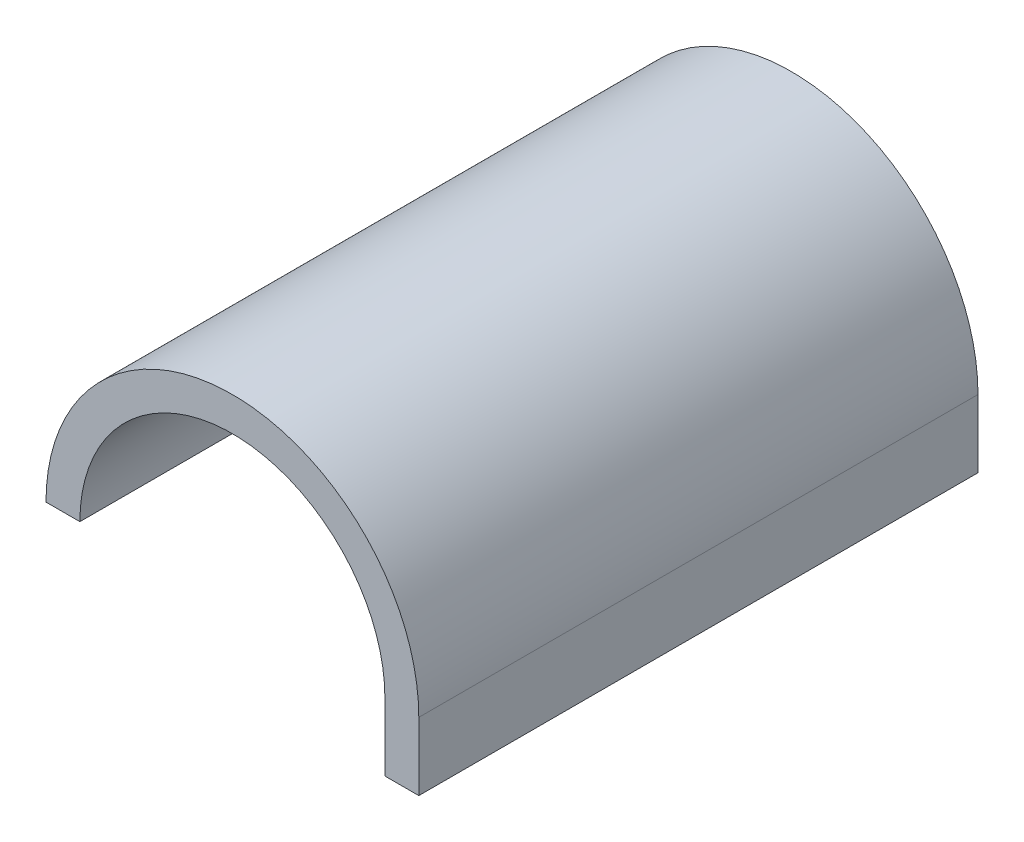
ISO-10303-21;
HEADER;
FILE_DESCRIPTION(('STEP AP214'),'2;1');
FILE_NAME('part.step','',(''),(''),'','','');
FILE_SCHEMA(('AUTOMOTIVE_DESIGN { 1 0 10303 214 1 1 1 1 }'));
ENDSEC;
DATA;
#1=APPLICATION_CONTEXT('core data for automotive mechanical design processes');
#2=APPLICATION_PROTOCOL_DEFINITION('international standard','automotive_design',2000,#1);
#3=PRODUCT_CONTEXT('',#1,'mechanical');
#4=PRODUCT('Part','Part','',(#3));
#5=PRODUCT_RELATED_PRODUCT_CATEGORY('part','',(#4));
#6=PRODUCT_DEFINITION_FORMATION('','',#4);
#7=PRODUCT_DEFINITION_CONTEXT('part definition',#1,'design');
#8=PRODUCT_DEFINITION('design','',#6,#7);
#9=PRODUCT_DEFINITION_SHAPE('','',#8);
#10=(LENGTH_UNIT() NAMED_UNIT(*) SI_UNIT(.MILLI.,.METRE.));
#11=(NAMED_UNIT(*) PLANE_ANGLE_UNIT() SI_UNIT($,.RADIAN.));
#12=(NAMED_UNIT(*) SI_UNIT($,.STERADIAN.) SOLID_ANGLE_UNIT());
#13=UNCERTAINTY_MEASURE_WITH_UNIT(LENGTH_MEASURE(1.E-05),#10,'distance_accuracy_value','');
#14=(GEOMETRIC_REPRESENTATION_CONTEXT(3) GLOBAL_UNCERTAINTY_ASSIGNED_CONTEXT((#13)) GLOBAL_UNIT_ASSIGNED_CONTEXT((#10,
#11,#12)) REPRESENTATION_CONTEXT('',''));
#15=CARTESIAN_POINT('',(0.,0.,0.));
#16=DIRECTION('',(0.,0.,1.));
#17=DIRECTION('',(1.,0.,0.));
#18=AXIS2_PLACEMENT_3D('',#15,#16,#17);
#19=CARTESIAN_POINT('',(0.,0.,82.5));
#20=DIRECTION('',(0.,0.,-1.));
#21=DIRECTION('',(-1.,0.,0.));
#22=AXIS2_PLACEMENT_3D('',#19,#20,#21);
#23=CYLINDRICAL_SURFACE('',#22,45.);
#24=CARTESIAN_POINT('',(0.,0.,-82.5));
#25=DIRECTION('',(0.,0.,-1.));
#26=DIRECTION('',(-1.,0.,0.));
#27=AXIS2_PLACEMENT_3D('',#24,#25,#26);
#28=CIRCLE('',#27,45.);
#29=CARTESIAN_POINT('',(-45.,0.,-82.5));
#30=VERTEX_POINT('',#29);
#31=CARTESIAN_POINT('',(45.,0.,-82.5));
#32=VERTEX_POINT('',#31);
#33=EDGE_CURVE('E115',#30,#32,#28,.T.);
#34=ORIENTED_EDGE('',*,*,#33,.T.);
#35=DIRECTION('',(0.,0.,-1.));
#36=VECTOR('',#35,1.);
#37=CARTESIAN_POINT('',(45.,0.,82.5));
#38=LINE('',#37,#36);
#39=CARTESIAN_POINT('',(45.,0.,82.5));
#40=VERTEX_POINT('',#39);
#41=EDGE_CURVE('E11',#40,#32,#38,.T.);
#42=ORIENTED_EDGE('',*,*,#41,.F.);
#43=CARTESIAN_POINT('',(0.,0.,82.5));
#44=DIRECTION('',(0.,0.,-1.));
#45=DIRECTION('',(-1.,0.,0.));
#46=AXIS2_PLACEMENT_3D('',#43,#44,#45);
#47=CIRCLE('',#46,45.);
#48=CARTESIAN_POINT('',(-45.,0.,82.5));
#49=VERTEX_POINT('',#48);
#50=EDGE_CURVE('E75',#49,#40,#47,.T.);
#51=ORIENTED_EDGE('',*,*,#50,.F.);
#52=DIRECTION('',(0.,0.,-1.));
#53=VECTOR('',#52,1.);
#54=CARTESIAN_POINT('',(-45.,0.,82.5));
#55=LINE('',#54,#53);
#56=EDGE_CURVE('E125',#49,#30,#55,.T.);
#57=ORIENTED_EDGE('',*,*,#56,.T.);
#58=EDGE_LOOP('',(#34,#42,#51,#57));
#59=FACE_BOUND('',#58,.T.);
#60=ADVANCED_FACE('F33',(#59),#23,.F.);
#61=CARTESIAN_POINT('',(0.,0.,82.5));
#62=DIRECTION('',(0.,0.,-1.));
#63=DIRECTION('',(-1.,0.,0.));
#64=AXIS2_PLACEMENT_3D('',#61,#62,#63);
#65=CYLINDRICAL_SURFACE('',#64,55.);
#66=CARTESIAN_POINT('',(0.,0.,-82.5));
#67=DIRECTION('',(0.,0.,1.));
#68=DIRECTION('',(-1.,0.,0.));
#69=AXIS2_PLACEMENT_3D('',#66,#67,#68);
#70=CIRCLE('',#69,55.);
#71=CARTESIAN_POINT('',(55.,0.,-82.5));
#72=VERTEX_POINT('',#71);
#73=CARTESIAN_POINT('',(-55.,0.,-82.5));
#74=VERTEX_POINT('',#73);
#75=EDGE_CURVE('E64',#72,#74,#70,.T.);
#76=ORIENTED_EDGE('',*,*,#75,.T.);
#77=DIRECTION('',(0.,0.,-1.));
#78=VECTOR('',#77,1.);
#79=CARTESIAN_POINT('',(-55.,0.,82.5));
#80=LINE('',#79,#78);
#81=CARTESIAN_POINT('',(-55.,0.,82.5));
#82=VERTEX_POINT('',#81);
#83=EDGE_CURVE('E130',#82,#74,#80,.T.);
#84=ORIENTED_EDGE('',*,*,#83,.F.);
#85=CARTESIAN_POINT('',(0.,0.,82.5));
#86=DIRECTION('',(0.,0.,1.));
#87=DIRECTION('',(-1.,0.,0.));
#88=AXIS2_PLACEMENT_3D('',#85,#86,#87);
#89=CIRCLE('',#88,55.);
#90=CARTESIAN_POINT('',(55.,0.,82.5));
#91=VERTEX_POINT('',#90);
#92=EDGE_CURVE('E123',#91,#82,#89,.T.);
#93=ORIENTED_EDGE('',*,*,#92,.F.);
#94=DIRECTION('',(0.,0.,-1.));
#95=VECTOR('',#94,1.);
#96=CARTESIAN_POINT('',(55.,0.,82.5));
#97=LINE('',#96,#95);
#98=EDGE_CURVE('E41',#91,#72,#97,.T.);
#99=ORIENTED_EDGE('',*,*,#98,.T.);
#100=EDGE_LOOP('',(#76,#84,#93,#99));
#101=FACE_BOUND('',#100,.T.);
#102=ADVANCED_FACE('F132',(#101),#65,.T.);
#103=CARTESIAN_POINT('',(-55.,0.,82.5));
#104=DIRECTION('',(0.,1.,0.));
#105=DIRECTION('',(-1.,0.,0.));
#106=AXIS2_PLACEMENT_3D('',#103,#104,#105);
#107=PLANE('',#106);
#108=DIRECTION('',(1.,0.,0.));
#109=VECTOR('',#108,1.);
#110=CARTESIAN_POINT('',(-55.,0.,-82.5));
#111=LINE('',#110,#109);
#112=EDGE_CURVE('E70',#74,#30,#111,.T.);
#113=ORIENTED_EDGE('',*,*,#112,.T.);
#114=ORIENTED_EDGE('',*,*,#56,.F.);
#115=DIRECTION('',(1.,0.,0.));
#116=VECTOR('',#115,1.);
#117=CARTESIAN_POINT('',(-55.,0.,82.5));
#118=LINE('',#117,#116);
#119=EDGE_CURVE('E49',#82,#49,#118,.T.);
#120=ORIENTED_EDGE('',*,*,#119,.F.);
#121=ORIENTED_EDGE('',*,*,#83,.T.);
#122=EDGE_LOOP('',(#113,#114,#120,#121));
#123=FACE_BOUND('',#122,.T.);
#124=ADVANCED_FACE('F142',(#123),#107,.F.);
#125=CARTESIAN_POINT('',(0.,0.,82.5));
#126=DIRECTION('',(0.,0.,-1.));
#127=DIRECTION('',(-1.,0.,0.));
#128=AXIS2_PLACEMENT_3D('',#125,#126,#127);
#129=PLANE('',#128);
#130=ORIENTED_EDGE('',*,*,#50,.T.);
#131=DIRECTION('',(0.,1.,0.));
#132=VECTOR('',#131,1.);
#133=CARTESIAN_POINT('',(45.,-20.,82.5));
#134=LINE('',#133,#132);
#135=CARTESIAN_POINT('',(45.,-20.,82.5));
#136=VERTEX_POINT('',#135);
#137=EDGE_CURVE('E138',#136,#40,#134,.T.);
#138=ORIENTED_EDGE('',*,*,#137,.F.);
#139=DIRECTION('',(-1.,0.,0.));
#140=VECTOR('',#139,1.);
#141=CARTESIAN_POINT('',(55.,-20.,82.5));
#142=LINE('',#141,#140);
#143=CARTESIAN_POINT('',(55.,-20.,82.5));
#144=VERTEX_POINT('',#143);
#145=EDGE_CURVE('E110',#144,#136,#142,.T.);
#146=ORIENTED_EDGE('',*,*,#145,.F.);
#147=DIRECTION('',(0.,1.,0.));
#148=VECTOR('',#147,1.);
#149=CARTESIAN_POINT('',(55.,-20.,82.5));
#150=LINE('',#149,#148);
#151=EDGE_CURVE('E118',#144,#91,#150,.T.);
#152=ORIENTED_EDGE('',*,*,#151,.T.);
#153=ORIENTED_EDGE('',*,*,#92,.T.);
#154=ORIENTED_EDGE('',*,*,#119,.T.);
#155=EDGE_LOOP('',(#130,#138,#146,#152,#153,#154));
#156=FACE_BOUND('',#155,.T.);
#157=ADVANCED_FACE('F141',(#156),#129,.F.);
#158=CARTESIAN_POINT('',(0.,0.,-82.5));
#159=DIRECTION('',(0.,0.,-1.));
#160=DIRECTION('',(-1.,0.,0.));
#161=AXIS2_PLACEMENT_3D('',#158,#159,#160);
#162=PLANE('',#161);
#163=ORIENTED_EDGE('',*,*,#33,.F.);
#164=ORIENTED_EDGE('',*,*,#112,.F.);
#165=ORIENTED_EDGE('',*,*,#75,.F.);
#166=DIRECTION('',(0.,1.,0.));
#167=VECTOR('',#166,1.);
#168=CARTESIAN_POINT('',(55.,-20.,-82.5));
#169=LINE('',#168,#167);
#170=CARTESIAN_POINT('',(55.,-20.,-82.5));
#171=VERTEX_POINT('',#170);
#172=EDGE_CURVE('E101',#171,#72,#169,.T.);
#173=ORIENTED_EDGE('',*,*,#172,.F.);
#174=DIRECTION('',(1.,0.,0.));
#175=VECTOR('',#174,1.);
#176=CARTESIAN_POINT('',(45.,-20.,-82.5));
#177=LINE('',#176,#175);
#178=CARTESIAN_POINT('',(45.,-20.,-82.5));
#179=VERTEX_POINT('',#178);
#180=EDGE_CURVE('E94',#179,#171,#177,.T.);
#181=ORIENTED_EDGE('',*,*,#180,.F.);
#182=DIRECTION('',(0.,1.,0.));
#183=VECTOR('',#182,1.);
#184=CARTESIAN_POINT('',(45.,-20.,-82.5));
#185=LINE('',#184,#183);
#186=EDGE_CURVE('E99',#179,#32,#185,.T.);
#187=ORIENTED_EDGE('',*,*,#186,.T.);
#188=EDGE_LOOP('',(#163,#164,#165,#173,#181,#187));
#189=FACE_BOUND('',#188,.T.);
#190=ADVANCED_FACE('F97',(#189),#162,.T.);
#191=CARTESIAN_POINT('',(45.,-20.,82.5));
#192=DIRECTION('',(1.,0.,0.));
#193=DIRECTION('',(0.,0.,-1.));
#194=AXIS2_PLACEMENT_3D('',#191,#192,#193);
#195=PLANE('',#194);
#196=ORIENTED_EDGE('',*,*,#41,.T.);
#197=ORIENTED_EDGE('',*,*,#186,.F.);
#198=DIRECTION('',(0.,0.,-1.));
#199=VECTOR('',#198,1.);
#200=CARTESIAN_POINT('',(45.,-20.,82.5));
#201=LINE('',#200,#199);
#202=EDGE_CURVE('E105',#136,#179,#201,.T.);
#203=ORIENTED_EDGE('',*,*,#202,.F.);
#204=ORIENTED_EDGE('',*,*,#137,.T.);
#205=EDGE_LOOP('',(#196,#197,#203,#204));
#206=FACE_BOUND('',#205,.T.);
#207=ADVANCED_FACE('F114',(#206),#195,.F.);
#208=CARTESIAN_POINT('',(55.,-20.,-82.5));
#209=DIRECTION('',(-1.,0.,0.));
#210=DIRECTION('',(0.,0.,1.));
#211=AXIS2_PLACEMENT_3D('',#208,#209,#210);
#212=PLANE('',#211);
#213=ORIENTED_EDGE('',*,*,#98,.F.);
#214=ORIENTED_EDGE('',*,*,#151,.F.);
#215=DIRECTION('',(0.,0.,1.));
#216=VECTOR('',#215,1.);
#217=CARTESIAN_POINT('',(55.,-20.,-82.5));
#218=LINE('',#217,#216);
#219=EDGE_CURVE('E104',#171,#144,#218,.T.);
#220=ORIENTED_EDGE('',*,*,#219,.F.);
#221=ORIENTED_EDGE('',*,*,#172,.T.);
#222=EDGE_LOOP('',(#213,#214,#220,#221));
#223=FACE_BOUND('',#222,.T.);
#224=ADVANCED_FACE('F136',(#223),#212,.F.);
#225=CARTESIAN_POINT('',(0.,-20.,0.));
#226=DIRECTION('',(0.,-1.,0.));
#227=DIRECTION('',(0.,0.,-1.));
#228=AXIS2_PLACEMENT_3D('',#225,#226,#227);
#229=PLANE('',#228);
#230=ORIENTED_EDGE('',*,*,#202,.T.);
#231=ORIENTED_EDGE('',*,*,#180,.T.);
#232=ORIENTED_EDGE('',*,*,#219,.T.);
#233=ORIENTED_EDGE('',*,*,#145,.T.);
#234=EDGE_LOOP('',(#230,#231,#232,#233));
#235=FACE_BOUND('',#234,.T.);
#236=ADVANCED_FACE('F108',(#235),#229,.T.);
#237=CLOSED_SHELL('',(#60,#102,#124,#157,#190,#207,#224,#236));
#238=MANIFOLD_SOLID_BREP('B2',#237);
#239=ADVANCED_BREP_SHAPE_REPRESENTATION('',(#18,#238),#14);
#240=SHAPE_DEFINITION_REPRESENTATION(#9,#239);
ENDSEC;
END-ISO-10303-21;
